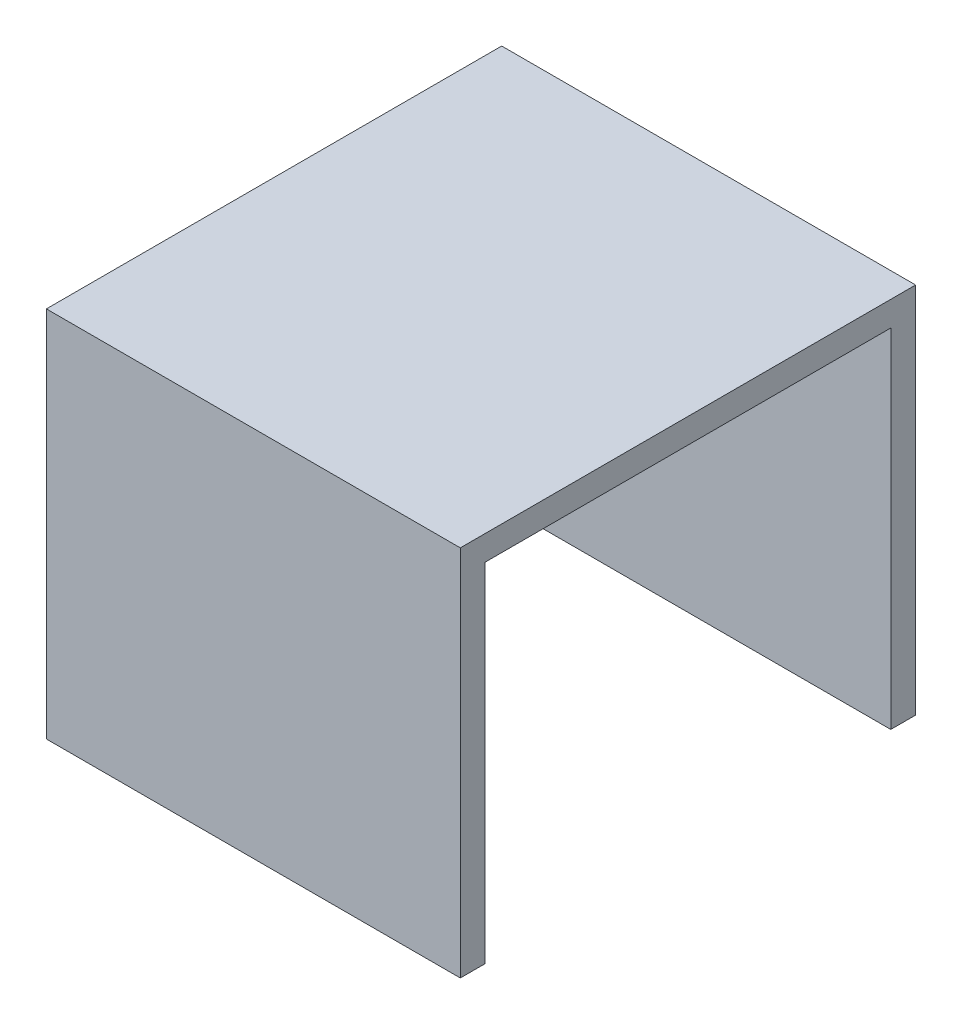
ISO-10303-21;
HEADER;
FILE_DESCRIPTION(('STEP AP214'),'2;1');
FILE_NAME('part.step','',(''),(''),'','','');
FILE_SCHEMA(('AUTOMOTIVE_DESIGN { 1 0 10303 214 1 1 1 1 }'));
ENDSEC;
DATA;
#1=APPLICATION_CONTEXT('core data for automotive mechanical design processes');
#2=APPLICATION_PROTOCOL_DEFINITION('international standard','automotive_design',2000,#1);
#3=PRODUCT_CONTEXT('',#1,'mechanical');
#4=PRODUCT('Part','Part','',(#3));
#5=PRODUCT_RELATED_PRODUCT_CATEGORY('part','',(#4));
#6=PRODUCT_DEFINITION_FORMATION('','',#4);
#7=PRODUCT_DEFINITION_CONTEXT('part definition',#1,'design');
#8=PRODUCT_DEFINITION('design','',#6,#7);
#9=PRODUCT_DEFINITION_SHAPE('','',#8);
#10=(LENGTH_UNIT() NAMED_UNIT(*) SI_UNIT(.MILLI.,.METRE.));
#11=(NAMED_UNIT(*) PLANE_ANGLE_UNIT() SI_UNIT($,.RADIAN.));
#12=(NAMED_UNIT(*) SI_UNIT($,.STERADIAN.) SOLID_ANGLE_UNIT());
#13=UNCERTAINTY_MEASURE_WITH_UNIT(LENGTH_MEASURE(1.E-05),#10,'distance_accuracy_value','');
#14=(GEOMETRIC_REPRESENTATION_CONTEXT(3) GLOBAL_UNCERTAINTY_ASSIGNED_CONTEXT((#13)) GLOBAL_UNIT_ASSIGNED_CONTEXT((#10,
#11,#12)) REPRESENTATION_CONTEXT('',''));
#15=CARTESIAN_POINT('',(0.,0.,0.));
#16=DIRECTION('',(0.,0.,1.));
#17=DIRECTION('',(1.,0.,0.));
#18=AXIS2_PLACEMENT_3D('',#15,#16,#17);
#19=CARTESIAN_POINT('',(1.15,1.695,0.));
#20=DIRECTION('',(0.,1.,0.));
#21=DIRECTION('',(0.707106781186548,0.,0.707106781186548));
#22=AXIS2_PLACEMENT_3D('',#19,#20,#21);
#23=PLANE('',#22);
#24=DIRECTION('',(-1.,0.,0.));
#25=VECTOR('',#24,1.);
#26=CARTESIAN_POINT('',(1.15,1.695,0.03));
#27=LINE('',#26,#25);
#28=CARTESIAN_POINT('',(1.15,1.695,0.03));
#29=VERTEX_POINT('',#28);
#30=CARTESIAN_POINT('',(0.65,1.695,0.03));
#31=VERTEX_POINT('',#30);
#32=EDGE_CURVE('E34',#29,#31,#27,.T.);
#33=ORIENTED_EDGE('',*,*,#32,.F.);
#34=DIRECTION('',(0.,0.,1.));
#35=VECTOR('',#34,1.);
#36=CARTESIAN_POINT('',(1.15,1.695,0.03));
#37=LINE('',#36,#35);
#38=CARTESIAN_POINT('',(1.15,1.695,0.52));
#39=VERTEX_POINT('',#38);
#40=EDGE_CURVE('E11',#29,#39,#37,.T.);
#41=ORIENTED_EDGE('',*,*,#40,.T.);
#42=DIRECTION('',(-1.,0.,0.));
#43=VECTOR('',#42,1.);
#44=CARTESIAN_POINT('',(1.15,1.695,0.52));
#45=LINE('',#44,#43);
#46=CARTESIAN_POINT('',(0.65,1.695,0.52));
#47=VERTEX_POINT('',#46);
#48=EDGE_CURVE('E26',#39,#47,#45,.T.);
#49=ORIENTED_EDGE('',*,*,#48,.T.);
#50=DIRECTION('',(0.,0.,1.));
#51=VECTOR('',#50,1.);
#52=CARTESIAN_POINT('',(0.65,1.695,0.03));
#53=LINE('',#52,#51);
#54=EDGE_CURVE('E124',#31,#47,#53,.T.);
#55=ORIENTED_EDGE('',*,*,#54,.F.);
#56=EDGE_LOOP('',(#33,#41,#49,#55));
#57=FACE_BOUND('',#56,.T.);
#58=ADVANCED_FACE('F16',(#57),#23,.F.);
#59=CARTESIAN_POINT('',(0.8,0.,0.03));
#60=DIRECTION('',(0.,0.,1.));
#61=DIRECTION('',(0.707106781186548,0.707106781186548,0.));
#62=AXIS2_PLACEMENT_3D('',#59,#60,#61);
#63=PLANE('',#62);
#64=DIRECTION('',(0.,1.,0.));
#65=VECTOR('',#64,1.);
#66=CARTESIAN_POINT('',(1.15,1.275,0.03));
#67=LINE('',#66,#65);
#68=CARTESIAN_POINT('',(1.15,1.275,0.03));
#69=VERTEX_POINT('',#68);
#70=EDGE_CURVE('E141',#69,#29,#67,.T.);
#71=ORIENTED_EDGE('',*,*,#70,.T.);
#72=ORIENTED_EDGE('',*,*,#32,.T.);
#73=DIRECTION('',(0.,-1.,0.));
#74=VECTOR('',#73,1.);
#75=CARTESIAN_POINT('',(0.65,1.695,0.03));
#76=LINE('',#75,#74);
#77=CARTESIAN_POINT('',(0.65,1.275,0.03));
#78=VERTEX_POINT('',#77);
#79=EDGE_CURVE('E139',#31,#78,#76,.T.);
#80=ORIENTED_EDGE('',*,*,#79,.T.);
#81=DIRECTION('',(1.,0.,0.));
#82=VECTOR('',#81,1.);
#83=CARTESIAN_POINT('',(0.65,1.275,0.03));
#84=LINE('',#83,#82);
#85=EDGE_CURVE('E89',#78,#69,#84,.T.);
#86=ORIENTED_EDGE('',*,*,#85,.T.);
#87=EDGE_LOOP('',(#71,#72,#80,#86));
#88=FACE_BOUND('',#87,.T.);
#89=ADVANCED_FACE('F148',(#88),#63,.T.);
#90=CARTESIAN_POINT('',(1.15,1.275,0.));
#91=DIRECTION('',(1.,0.,0.));
#92=DIRECTION('',(0.,0.707106781186548,0.707106781186548));
#93=AXIS2_PLACEMENT_3D('',#90,#91,#92);
#94=PLANE('',#93);
#95=ORIENTED_EDGE('',*,*,#70,.F.);
#96=DIRECTION('',(0.,0.,1.));
#97=VECTOR('',#96,1.);
#98=CARTESIAN_POINT('',(1.15,1.275,0.));
#99=LINE('',#98,#97);
#100=CARTESIAN_POINT('',(1.15,1.275,0.));
#101=VERTEX_POINT('',#100);
#102=EDGE_CURVE('E104',#101,#69,#99,.T.);
#103=ORIENTED_EDGE('',*,*,#102,.F.);
#104=DIRECTION('',(0.,1.,0.));
#105=VECTOR('',#104,1.);
#106=CARTESIAN_POINT('',(1.15,1.275,0.));
#107=LINE('',#106,#105);
#108=CARTESIAN_POINT('',(1.15,1.725,0.));
#109=VERTEX_POINT('',#108);
#110=EDGE_CURVE('E103',#101,#109,#107,.T.);
#111=ORIENTED_EDGE('',*,*,#110,.T.);
#112=DIRECTION('',(0.,0.,1.));
#113=VECTOR('',#112,1.);
#114=CARTESIAN_POINT('',(1.15,1.725,0.));
#115=LINE('',#114,#113);
#116=CARTESIAN_POINT('',(1.15,1.725,0.55));
#117=VERTEX_POINT('',#116);
#118=EDGE_CURVE('E132',#109,#117,#115,.T.);
#119=ORIENTED_EDGE('',*,*,#118,.T.);
#120=DIRECTION('',(0.,1.,0.));
#121=VECTOR('',#120,1.);
#122=CARTESIAN_POINT('',(1.15,1.275,0.55));
#123=LINE('',#122,#121);
#124=CARTESIAN_POINT('',(1.15,1.275,0.55));
#125=VERTEX_POINT('',#124);
#126=EDGE_CURVE('E118',#125,#117,#123,.T.);
#127=ORIENTED_EDGE('',*,*,#126,.F.);
#128=DIRECTION('',(0.,0.,1.));
#129=VECTOR('',#128,1.);
#130=CARTESIAN_POINT('',(1.15,1.275,0.52));
#131=LINE('',#130,#129);
#132=CARTESIAN_POINT('',(1.15,1.275,0.52));
#133=VERTEX_POINT('',#132);
#134=EDGE_CURVE('E128',#133,#125,#131,.T.);
#135=ORIENTED_EDGE('',*,*,#134,.F.);
#136=DIRECTION('',(0.,1.,0.));
#137=VECTOR('',#136,1.);
#138=CARTESIAN_POINT('',(1.15,1.275,0.52));
#139=LINE('',#138,#137);
#140=EDGE_CURVE('E129',#133,#39,#139,.T.);
#141=ORIENTED_EDGE('',*,*,#140,.T.);
#142=ORIENTED_EDGE('',*,*,#40,.F.);
#143=EDGE_LOOP('',(#95,#103,#111,#119,#127,#135,#141,#142));
#144=FACE_BOUND('',#143,.T.);
#145=ADVANCED_FACE('F161',(#144),#94,.T.);
#146=CARTESIAN_POINT('',(0.8,0.,0.52));
#147=DIRECTION('',(0.,0.,1.));
#148=DIRECTION('',(0.707106781186548,0.707106781186548,0.));
#149=AXIS2_PLACEMENT_3D('',#146,#147,#148);
#150=PLANE('',#149);
#151=ORIENTED_EDGE('',*,*,#48,.F.);
#152=ORIENTED_EDGE('',*,*,#140,.F.);
#153=DIRECTION('',(1.,0.,0.));
#154=VECTOR('',#153,1.);
#155=CARTESIAN_POINT('',(0.65,1.275,0.52));
#156=LINE('',#155,#154);
#157=CARTESIAN_POINT('',(0.65,1.275,0.52));
#158=VERTEX_POINT('',#157);
#159=EDGE_CURVE('E125',#158,#133,#156,.T.);
#160=ORIENTED_EDGE('',*,*,#159,.F.);
#161=DIRECTION('',(0.,-1.,0.));
#162=VECTOR('',#161,1.);
#163=CARTESIAN_POINT('',(0.65,1.695,0.52));
#164=LINE('',#163,#162);
#165=EDGE_CURVE('E121',#47,#158,#164,.T.);
#166=ORIENTED_EDGE('',*,*,#165,.F.);
#167=EDGE_LOOP('',(#151,#152,#160,#166));
#168=FACE_BOUND('',#167,.T.);
#169=ADVANCED_FACE('F154',(#168),#150,.F.);
#170=CARTESIAN_POINT('',(0.65,1.725,0.));
#171=DIRECTION('',(-1.,0.,0.));
#172=DIRECTION('',(0.,0.707106781186548,0.707106781186548));
#173=AXIS2_PLACEMENT_3D('',#170,#171,#172);
#174=PLANE('',#173);
#175=ORIENTED_EDGE('',*,*,#79,.F.);
#176=ORIENTED_EDGE('',*,*,#54,.T.);
#177=ORIENTED_EDGE('',*,*,#165,.T.);
#178=DIRECTION('',(0.,0.,1.));
#179=VECTOR('',#178,1.);
#180=CARTESIAN_POINT('',(0.65,1.275,0.52));
#181=LINE('',#180,#179);
#182=CARTESIAN_POINT('',(0.65,1.275,0.55));
#183=VERTEX_POINT('',#182);
#184=EDGE_CURVE('E98',#158,#183,#181,.T.);
#185=ORIENTED_EDGE('',*,*,#184,.T.);
#186=DIRECTION('',(0.,-1.,0.));
#187=VECTOR('',#186,1.);
#188=CARTESIAN_POINT('',(0.65,1.725,0.55));
#189=LINE('',#188,#187);
#190=CARTESIAN_POINT('',(0.65,1.725,0.55));
#191=VERTEX_POINT('',#190);
#192=EDGE_CURVE('E111',#191,#183,#189,.T.);
#193=ORIENTED_EDGE('',*,*,#192,.F.);
#194=DIRECTION('',(0.,0.,1.));
#195=VECTOR('',#194,1.);
#196=CARTESIAN_POINT('',(0.65,1.725,0.));
#197=LINE('',#196,#195);
#198=CARTESIAN_POINT('',(0.65,1.725,0.));
#199=VERTEX_POINT('',#198);
#200=EDGE_CURVE('E78',#199,#191,#197,.T.);
#201=ORIENTED_EDGE('',*,*,#200,.F.);
#202=DIRECTION('',(0.,-1.,0.));
#203=VECTOR('',#202,1.);
#204=CARTESIAN_POINT('',(0.65,1.725,0.));
#205=LINE('',#204,#203);
#206=CARTESIAN_POINT('',(0.65,1.275,0.));
#207=VERTEX_POINT('',#206);
#208=EDGE_CURVE('E92',#199,#207,#205,.T.);
#209=ORIENTED_EDGE('',*,*,#208,.T.);
#210=DIRECTION('',(0.,0.,1.));
#211=VECTOR('',#210,1.);
#212=CARTESIAN_POINT('',(0.65,1.275,0.));
#213=LINE('',#212,#211);
#214=EDGE_CURVE('E84',#207,#78,#213,.T.);
#215=ORIENTED_EDGE('',*,*,#214,.T.);
#216=EDGE_LOOP('',(#175,#176,#177,#185,#193,#201,#209,#215));
#217=FACE_BOUND('',#216,.T.);
#218=ADVANCED_FACE('F94',(#217),#174,.T.);
#219=CARTESIAN_POINT('',(0.65,1.275,0.));
#220=DIRECTION('',(0.,-1.,0.));
#221=DIRECTION('',(0.707106781186548,0.,0.707106781186548));
#222=AXIS2_PLACEMENT_3D('',#219,#220,#221);
#223=PLANE('',#222);
#224=ORIENTED_EDGE('',*,*,#85,.F.);
#225=ORIENTED_EDGE('',*,*,#214,.F.);
#226=DIRECTION('',(1.,0.,0.));
#227=VECTOR('',#226,1.);
#228=CARTESIAN_POINT('',(0.65,1.275,0.));
#229=LINE('',#228,#227);
#230=EDGE_CURVE('E88',#207,#101,#229,.T.);
#231=ORIENTED_EDGE('',*,*,#230,.T.);
#232=ORIENTED_EDGE('',*,*,#102,.T.);
#233=EDGE_LOOP('',(#224,#225,#231,#232));
#234=FACE_BOUND('',#233,.T.);
#235=ADVANCED_FACE('F85',(#234),#223,.T.);
#236=CARTESIAN_POINT('',(0.8,0.,0.));
#237=DIRECTION('',(0.,0.,1.));
#238=DIRECTION('',(0.707106781186548,0.707106781186548,0.));
#239=AXIS2_PLACEMENT_3D('',#236,#237,#238);
#240=PLANE('',#239);
#241=ORIENTED_EDGE('',*,*,#110,.F.);
#242=ORIENTED_EDGE('',*,*,#230,.F.);
#243=ORIENTED_EDGE('',*,*,#208,.F.);
#244=DIRECTION('',(-1.,0.,0.));
#245=VECTOR('',#244,1.);
#246=CARTESIAN_POINT('',(1.15,1.725,0.));
#247=LINE('',#246,#245);
#248=EDGE_CURVE('E106',#109,#199,#247,.T.);
#249=ORIENTED_EDGE('',*,*,#248,.F.);
#250=EDGE_LOOP('',(#241,#242,#243,#249));
#251=FACE_BOUND('',#250,.T.);
#252=ADVANCED_FACE('F101',(#251),#240,.F.);
#253=CARTESIAN_POINT('',(1.15,1.725,0.));
#254=DIRECTION('',(0.,1.,0.));
#255=DIRECTION('',(0.707106781186548,0.,0.707106781186548));
#256=AXIS2_PLACEMENT_3D('',#253,#254,#255);
#257=PLANE('',#256);
#258=ORIENTED_EDGE('',*,*,#248,.T.);
#259=ORIENTED_EDGE('',*,*,#200,.T.);
#260=DIRECTION('',(-1.,0.,0.));
#261=VECTOR('',#260,1.);
#262=CARTESIAN_POINT('',(1.15,1.725,0.55));
#263=LINE('',#262,#261);
#264=EDGE_CURVE('E109',#117,#191,#263,.T.);
#265=ORIENTED_EDGE('',*,*,#264,.F.);
#266=ORIENTED_EDGE('',*,*,#118,.F.);
#267=EDGE_LOOP('',(#258,#259,#265,#266));
#268=FACE_BOUND('',#267,.T.);
#269=ADVANCED_FACE('F159',(#268),#257,.T.);
#270=CARTESIAN_POINT('',(0.8,0.,0.55));
#271=DIRECTION('',(0.,0.,1.));
#272=DIRECTION('',(0.707106781186548,0.707106781186548,0.));
#273=AXIS2_PLACEMENT_3D('',#270,#271,#272);
#274=PLANE('',#273);
#275=ORIENTED_EDGE('',*,*,#264,.T.);
#276=ORIENTED_EDGE('',*,*,#192,.T.);
#277=DIRECTION('',(1.,0.,0.));
#278=VECTOR('',#277,1.);
#279=CARTESIAN_POINT('',(0.65,1.275,0.55));
#280=LINE('',#279,#278);
#281=EDGE_CURVE('E20',#183,#125,#280,.T.);
#282=ORIENTED_EDGE('',*,*,#281,.T.);
#283=ORIENTED_EDGE('',*,*,#126,.T.);
#284=EDGE_LOOP('',(#275,#276,#282,#283));
#285=FACE_BOUND('',#284,.T.);
#286=ADVANCED_FACE('F162',(#285),#274,.T.);
#287=CARTESIAN_POINT('',(0.65,1.275,0.));
#288=DIRECTION('',(0.,-1.,0.));
#289=DIRECTION('',(0.707106781186548,0.,0.707106781186548));
#290=AXIS2_PLACEMENT_3D('',#287,#288,#289);
#291=PLANE('',#290);
#292=ORIENTED_EDGE('',*,*,#159,.T.);
#293=ORIENTED_EDGE('',*,*,#134,.T.);
#294=ORIENTED_EDGE('',*,*,#281,.F.);
#295=ORIENTED_EDGE('',*,*,#184,.F.);
#296=EDGE_LOOP('',(#292,#293,#294,#295));
#297=FACE_BOUND('',#296,.T.);
#298=ADVANCED_FACE('F18',(#297),#291,.T.);
#299=CLOSED_SHELL('',(#58,#89,#145,#169,#218,#235,#252,#269,#286,#298));
#300=MANIFOLD_SOLID_BREP('B1',#299);
#301=ADVANCED_BREP_SHAPE_REPRESENTATION('',(#18,#300),#14);
#302=SHAPE_DEFINITION_REPRESENTATION(#9,#301);
ENDSEC;
END-ISO-10303-21;
